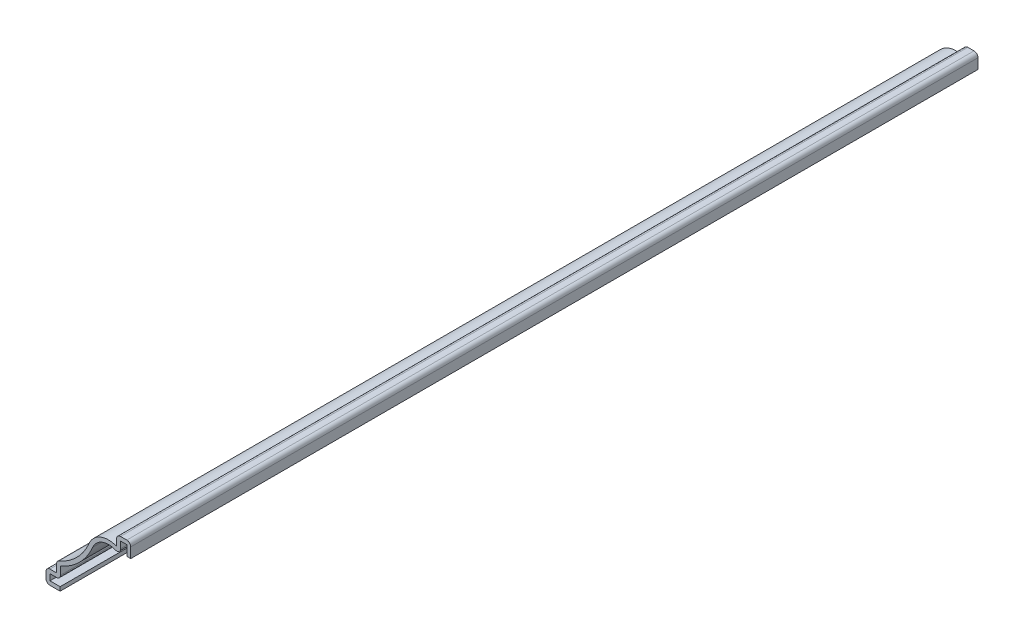
ISO-10303-21;
HEADER;
FILE_DESCRIPTION(('STEP AP214'),'2;1');
FILE_NAME('part.step','',(''),(''),'','','');
FILE_SCHEMA(('AUTOMOTIVE_DESIGN { 1 0 10303 214 1 1 1 1 }'));
ENDSEC;
DATA;
#1=APPLICATION_CONTEXT('core data for automotive mechanical design processes');
#2=APPLICATION_PROTOCOL_DEFINITION('international standard','automotive_design',2000,#1);
#3=PRODUCT_CONTEXT('',#1,'mechanical');
#4=PRODUCT('Part','Part','',(#3));
#5=PRODUCT_RELATED_PRODUCT_CATEGORY('part','',(#4));
#6=PRODUCT_DEFINITION_FORMATION('','',#4);
#7=PRODUCT_DEFINITION_CONTEXT('part definition',#1,'design');
#8=PRODUCT_DEFINITION('design','',#6,#7);
#9=PRODUCT_DEFINITION_SHAPE('','',#8);
#10=(LENGTH_UNIT() NAMED_UNIT(*) SI_UNIT(.MILLI.,.METRE.));
#11=(NAMED_UNIT(*) PLANE_ANGLE_UNIT() SI_UNIT($,.RADIAN.));
#12=(NAMED_UNIT(*) SI_UNIT($,.STERADIAN.) SOLID_ANGLE_UNIT());
#13=UNCERTAINTY_MEASURE_WITH_UNIT(LENGTH_MEASURE(1.E-05),#10,'distance_accuracy_value','');
#14=(GEOMETRIC_REPRESENTATION_CONTEXT(3) GLOBAL_UNCERTAINTY_ASSIGNED_CONTEXT((#13)) GLOBAL_UNIT_ASSIGNED_CONTEXT((#10,
#11,#12)) REPRESENTATION_CONTEXT('',''));
#15=CARTESIAN_POINT('',(0.,0.,0.));
#16=DIRECTION('',(0.,0.,1.));
#17=DIRECTION('',(1.,0.,0.));
#18=AXIS2_PLACEMENT_3D('',#15,#16,#17);
#19=CARTESIAN_POINT('',(-19.05,0.,-190.5));
#20=DIRECTION('',(0.,-1.,0.));
#21=DIRECTION('',(0.,0.,-1.));
#22=AXIS2_PLACEMENT_3D('',#19,#20,#21);
#23=PLANE('',#22);
#24=DIRECTION('',(1.,0.,0.));
#25=VECTOR('',#24,1.);
#26=CARTESIAN_POINT('',(-19.05,0.,0.));
#27=LINE('',#26,#25);
#28=CARTESIAN_POINT('',(-18.161,0.,0.));
#29=VERTEX_POINT('',#28);
#30=CARTESIAN_POINT('',(-15.875,0.,0.));
#31=VERTEX_POINT('',#30);
#32=EDGE_CURVE('E407',#29,#31,#27,.T.);
#33=ORIENTED_EDGE('',*,*,#32,.F.);
#34=DIRECTION('',(0.,0.,1.));
#35=VECTOR('',#34,1.);
#36=CARTESIAN_POINT('',(-18.161,0.,-190.5));
#37=LINE('',#36,#35);
#38=CARTESIAN_POINT('',(-18.161,0.,-190.5));
#39=VERTEX_POINT('',#38);
#40=EDGE_CURVE('E223',#29,#39,#37,.F.);
#41=ORIENTED_EDGE('',*,*,#40,.T.);
#42=DIRECTION('',(1.,0.,0.));
#43=VECTOR('',#42,1.);
#44=CARTESIAN_POINT('',(-19.05,0.,-190.5));
#45=LINE('',#44,#43);
#46=CARTESIAN_POINT('',(-15.875,0.,-190.5));
#47=VERTEX_POINT('',#46);
#48=EDGE_CURVE('E216',#39,#47,#45,.T.);
#49=ORIENTED_EDGE('',*,*,#48,.T.);
#50=DIRECTION('',(0.,0.,1.));
#51=VECTOR('',#50,1.);
#52=CARTESIAN_POINT('',(-15.875,0.,-190.5));
#53=LINE('',#52,#51);
#54=EDGE_CURVE('E220',#47,#31,#53,.T.);
#55=ORIENTED_EDGE('',*,*,#54,.T.);
#56=EDGE_LOOP('',(#33,#41,#49,#55));
#57=FACE_BOUND('',#56,.T.);
#58=ADVANCED_FACE('F35',(#57),#23,.T.);
#59=CARTESIAN_POINT('',(-19.05,3.175,-190.5));
#60=DIRECTION('',(-1.,0.,0.));
#61=DIRECTION('',(0.,0.,1.));
#62=AXIS2_PLACEMENT_3D('',#59,#60,#61);
#63=PLANE('',#62);
#64=DIRECTION('',(0.,-1.,0.));
#65=VECTOR('',#64,1.);
#66=CARTESIAN_POINT('',(-19.05,3.175,-190.5));
#67=LINE('',#66,#65);
#68=CARTESIAN_POINT('',(-19.05,2.286,-190.5));
#69=VERTEX_POINT('',#68);
#70=CARTESIAN_POINT('',(-19.05,0.889,-190.5));
#71=VERTEX_POINT('',#70);
#72=EDGE_CURVE('E241',#69,#71,#67,.T.);
#73=ORIENTED_EDGE('',*,*,#72,.T.);
#74=DIRECTION('',(0.,0.,1.));
#75=VECTOR('',#74,1.);
#76=CARTESIAN_POINT('',(-19.05,0.889,-190.5));
#77=LINE('',#76,#75);
#78=CARTESIAN_POINT('',(-19.05,0.889,0.));
#79=VERTEX_POINT('',#78);
#80=EDGE_CURVE('E287',#71,#79,#77,.T.);
#81=ORIENTED_EDGE('',*,*,#80,.T.);
#82=DIRECTION('',(0.,-1.,0.));
#83=VECTOR('',#82,1.);
#84=CARTESIAN_POINT('',(-19.05,3.175,0.));
#85=LINE('',#84,#83);
#86=CARTESIAN_POINT('',(-19.05,2.286,0.));
#87=VERTEX_POINT('',#86);
#88=EDGE_CURVE('E226',#87,#79,#85,.T.);
#89=ORIENTED_EDGE('',*,*,#88,.F.);
#90=DIRECTION('',(0.,0.,1.));
#91=VECTOR('',#90,1.);
#92=CARTESIAN_POINT('',(-19.05,2.286,-190.5));
#93=LINE('',#92,#91);
#94=EDGE_CURVE('E285',#87,#69,#93,.F.);
#95=ORIENTED_EDGE('',*,*,#94,.T.);
#96=EDGE_LOOP('',(#73,#81,#89,#95));
#97=FACE_BOUND('',#96,.T.);
#98=ADVANCED_FACE('F458',(#97),#63,.T.);
#99=CARTESIAN_POINT('',(-16.66875,3.175,-190.5));
#100=DIRECTION('',(0.,1.,0.));
#101=DIRECTION('',(-1.,0.,0.));
#102=AXIS2_PLACEMENT_3D('',#99,#100,#101);
#103=PLANE('',#102);
#104=DIRECTION('',(-1.,0.,0.));
#105=VECTOR('',#104,1.);
#106=CARTESIAN_POINT('',(-16.66875,3.175,-190.5));
#107=LINE('',#106,#105);
#108=CARTESIAN_POINT('',(-16.66875,3.175,-190.5));
#109=VERTEX_POINT('',#108);
#110=CARTESIAN_POINT('',(-18.161,3.175,-190.5));
#111=VERTEX_POINT('',#110);
#112=EDGE_CURVE('E246',#109,#111,#107,.T.);
#113=ORIENTED_EDGE('',*,*,#112,.T.);
#114=DIRECTION('',(0.,0.,1.));
#115=VECTOR('',#114,1.);
#116=CARTESIAN_POINT('',(-18.161,3.175,-190.5));
#117=LINE('',#116,#115);
#118=CARTESIAN_POINT('',(-18.161,3.175,0.));
#119=VERTEX_POINT('',#118);
#120=EDGE_CURVE('E291',#111,#119,#117,.T.);
#121=ORIENTED_EDGE('',*,*,#120,.T.);
#122=DIRECTION('',(-1.,0.,0.));
#123=VECTOR('',#122,1.);
#124=CARTESIAN_POINT('',(-16.66875,3.175,0.));
#125=LINE('',#124,#123);
#126=CARTESIAN_POINT('',(-16.66875,3.175,0.));
#127=VERTEX_POINT('',#126);
#128=EDGE_CURVE('E364',#127,#119,#125,.T.);
#129=ORIENTED_EDGE('',*,*,#128,.F.);
#130=DIRECTION('',(0.,0.,1.));
#131=VECTOR('',#130,1.);
#132=CARTESIAN_POINT('',(-16.66875,3.175,-190.5));
#133=LINE('',#132,#131);
#134=EDGE_CURVE('E253',#109,#127,#133,.T.);
#135=ORIENTED_EDGE('',*,*,#134,.F.);
#136=EDGE_LOOP('',(#113,#121,#129,#135));
#137=FACE_BOUND('',#136,.T.);
#138=ADVANCED_FACE('F468',(#137),#103,.T.);
#139=CARTESIAN_POINT('',(-16.66875,5.55625,-190.5));
#140=DIRECTION('',(-1.,0.,0.));
#141=DIRECTION('',(0.,0.,1.));
#142=AXIS2_PLACEMENT_3D('',#139,#140,#141);
#143=PLANE('',#142);
#144=DIRECTION('',(0.,-1.,0.));
#145=VECTOR('',#144,1.);
#146=CARTESIAN_POINT('',(-16.66875,5.55625,0.));
#147=LINE('',#146,#145);
#148=CARTESIAN_POINT('',(-16.66875,4.95323651991083,0.));
#149=VERTEX_POINT('',#148);
#150=EDGE_CURVE('E362',#149,#127,#147,.T.);
#151=ORIENTED_EDGE('',*,*,#150,.F.);
#152=DIRECTION('',(0.,0.,1.));
#153=VECTOR('',#152,1.);
#154=CARTESIAN_POINT('',(-16.66875,4.95323651991083,-190.5));
#155=LINE('',#154,#153);
#156=CARTESIAN_POINT('',(-16.66875,4.95323651991083,-190.5));
#157=VERTEX_POINT('',#156);
#158=EDGE_CURVE('E301',#149,#157,#155,.F.);
#159=ORIENTED_EDGE('',*,*,#158,.T.);
#160=DIRECTION('',(0.,-1.,0.));
#161=VECTOR('',#160,1.);
#162=CARTESIAN_POINT('',(-16.66875,5.55625,-190.5));
#163=LINE('',#162,#161);
#164=EDGE_CURVE('E449',#157,#109,#163,.T.);
#165=ORIENTED_EDGE('',*,*,#164,.T.);
#166=ORIENTED_EDGE('',*,*,#134,.T.);
#167=EDGE_LOOP('',(#151,#159,#165,#166));
#168=FACE_BOUND('',#167,.T.);
#169=ADVANCED_FACE('F472',(#168),#143,.T.);
#170=CARTESIAN_POINT('',(-21.0881629629963,17.4625,-190.5));
#171=DIRECTION('',(0.,0.,1.));
#172=DIRECTION('',(1.,0.,0.));
#173=AXIS2_PLACEMENT_3D('',#170,#171,#172);
#174=CYLINDRICAL_SURFACE('',#173,12.7);
#175=CARTESIAN_POINT('',(-21.0881629629963,17.4625,-190.5));
#176=DIRECTION('',(0.,0.,-1.));
#177=DIRECTION('',(-1.,0.,0.));
#178=AXIS2_PLACEMENT_3D('',#175,#176,#177);
#179=CIRCLE('',#178,12.7);
#180=CARTESIAN_POINT('',(-9.38501074974399,12.5303373634432,-190.5));
#181=VERTEX_POINT('',#180);
#182=CARTESIAN_POINT('',(-16.1270293527194,5.77159955131854,-190.5));
#183=VERTEX_POINT('',#182);
#184=EDGE_CURVE('E446',#181,#183,#179,.T.);
#185=ORIENTED_EDGE('',*,*,#184,.T.);
#186=DIRECTION('',(0.,0.,1.));
#187=VECTOR('',#186,1.);
#188=CARTESIAN_POINT('',(-16.1270293527194,5.77159955131854,-190.5));
#189=LINE('',#188,#187);
#190=CARTESIAN_POINT('',(-16.1270293527194,5.77159955131854,0.));
#191=VERTEX_POINT('',#190);
#192=EDGE_CURVE('E298',#183,#191,#189,.T.);
#193=ORIENTED_EDGE('',*,*,#192,.T.);
#194=CARTESIAN_POINT('',(-21.0881629629963,17.4625,0.));
#195=DIRECTION('',(0.,0.,-1.));
#196=DIRECTION('',(-1.,0.,0.));
#197=AXIS2_PLACEMENT_3D('',#194,#195,#196);
#198=CIRCLE('',#197,12.7);
#199=CARTESIAN_POINT('',(-9.38501074974399,12.5303373634432,0.));
#200=VERTEX_POINT('',#199);
#201=EDGE_CURVE('E359',#200,#191,#198,.T.);
#202=ORIENTED_EDGE('',*,*,#201,.F.);
#203=DIRECTION('',(0.,0.,1.));
#204=VECTOR('',#203,1.);
#205=CARTESIAN_POINT('',(-9.38501074974399,12.5303373634432,-190.5));
#206=LINE('',#205,#204);
#207=EDGE_CURVE('E371',#181,#200,#206,.T.);
#208=ORIENTED_EDGE('',*,*,#207,.F.);
#209=EDGE_LOOP('',(#185,#193,#202,#208));
#210=FACE_BOUND('',#209,.T.);
#211=ADVANCED_FACE('F481',(#210),#174,.F.);
#212=CARTESIAN_POINT('',(-4.99632866977436,10.6807763747344,-190.5));
#213=DIRECTION('',(0.,0.,1.));
#214=DIRECTION('',(1.,0.,0.));
#215=AXIS2_PLACEMENT_3D('',#212,#213,#214);
#216=CYLINDRICAL_SURFACE('',#215,4.7625);
#217=CARTESIAN_POINT('',(-4.99632866977436,10.6807763747344,0.));
#218=DIRECTION('',(0.,0.,1.));
#219=DIRECTION('',(1.,0.,0.));
#220=AXIS2_PLACEMENT_3D('',#217,#218,#219);
#221=CIRCLE('',#220,4.7625);
#222=CARTESIAN_POINT('',(-3.175,15.08125,0.));
#223=VERTEX_POINT('',#222);
#224=EDGE_CURVE('E356',#223,#200,#221,.T.);
#225=ORIENTED_EDGE('',*,*,#224,.F.);
#226=DIRECTION('',(0.,0.,1.));
#227=VECTOR('',#226,1.);
#228=CARTESIAN_POINT('',(-3.175,15.08125,-190.5));
#229=LINE('',#228,#227);
#230=CARTESIAN_POINT('',(-3.175,15.08125,-190.5));
#231=VERTEX_POINT('',#230);
#232=EDGE_CURVE('E373',#231,#223,#229,.T.);
#233=ORIENTED_EDGE('',*,*,#232,.F.);
#234=CARTESIAN_POINT('',(-4.99632866977436,10.6807763747344,-190.5));
#235=DIRECTION('',(0.,0.,1.));
#236=DIRECTION('',(1.,0.,0.));
#237=AXIS2_PLACEMENT_3D('',#234,#235,#236);
#238=CIRCLE('',#237,4.7625);
#239=EDGE_CURVE('E443',#231,#181,#238,.T.);
#240=ORIENTED_EDGE('',*,*,#239,.T.);
#241=ORIENTED_EDGE('',*,*,#207,.T.);
#242=EDGE_LOOP('',(#225,#233,#240,#241));
#243=FACE_BOUND('',#242,.T.);
#244=ADVANCED_FACE('F486',(#243),#216,.T.);
#245=CARTESIAN_POINT('',(-3.175,17.4625,-190.5));
#246=DIRECTION('',(-1.,0.,0.));
#247=DIRECTION('',(0.,0.,1.));
#248=AXIS2_PLACEMENT_3D('',#245,#246,#247);
#249=PLANE('',#248);
#250=DIRECTION('',(0.,-1.,0.));
#251=VECTOR('',#250,1.);
#252=CARTESIAN_POINT('',(-3.175,17.4625,0.));
#253=LINE('',#252,#251);
#254=CARTESIAN_POINT('',(-3.175,16.5735,0.));
#255=VERTEX_POINT('',#254);
#256=EDGE_CURVE('E354',#255,#223,#253,.T.);
#257=ORIENTED_EDGE('',*,*,#256,.F.);
#258=DIRECTION('',(0.,0.,1.));
#259=VECTOR('',#258,1.);
#260=CARTESIAN_POINT('',(-3.175,16.5735,-190.5));
#261=LINE('',#260,#259);
#262=CARTESIAN_POINT('',(-3.175,16.5735,-190.5));
#263=VERTEX_POINT('',#262);
#264=EDGE_CURVE('E270',#255,#263,#261,.F.);
#265=ORIENTED_EDGE('',*,*,#264,.T.);
#266=DIRECTION('',(0.,-1.,0.));
#267=VECTOR('',#266,1.);
#268=CARTESIAN_POINT('',(-3.175,17.4625,-190.5));
#269=LINE('',#268,#267);
#270=EDGE_CURVE('E441',#263,#231,#269,.T.);
#271=ORIENTED_EDGE('',*,*,#270,.T.);
#272=ORIENTED_EDGE('',*,*,#232,.T.);
#273=EDGE_LOOP('',(#257,#265,#271,#272));
#274=FACE_BOUND('',#273,.T.);
#275=ADVANCED_FACE('F660',(#274),#249,.T.);
#276=CARTESIAN_POINT('',(0.,17.4625,-190.5));
#277=DIRECTION('',(0.,1.,0.));
#278=DIRECTION('',(0.,0.,1.));
#279=AXIS2_PLACEMENT_3D('',#276,#277,#278);
#280=PLANE('',#279);
#281=DIRECTION('',(-1.,0.,0.));
#282=VECTOR('',#281,1.);
#283=CARTESIAN_POINT('',(0.,17.4625,-190.5));
#284=LINE('',#283,#282);
#285=CARTESIAN_POINT('',(-0.889,17.4625,-190.5));
#286=VERTEX_POINT('',#285);
#287=CARTESIAN_POINT('',(-2.286,17.4625,-190.5));
#288=VERTEX_POINT('',#287);
#289=EDGE_CURVE('E438',#286,#288,#284,.T.);
#290=ORIENTED_EDGE('',*,*,#289,.T.);
#291=DIRECTION('',(0.,0.,1.));
#292=VECTOR('',#291,1.);
#293=CARTESIAN_POINT('',(-2.286,17.4625,-190.5));
#294=LINE('',#293,#292);
#295=CARTESIAN_POINT('',(-2.286,17.4625,0.));
#296=VERTEX_POINT('',#295);
#297=EDGE_CURVE('E252',#288,#296,#294,.T.);
#298=ORIENTED_EDGE('',*,*,#297,.T.);
#299=DIRECTION('',(-1.,0.,0.));
#300=VECTOR('',#299,1.);
#301=CARTESIAN_POINT('',(0.,17.4625,0.));
#302=LINE('',#301,#300);
#303=CARTESIAN_POINT('',(-0.889,17.4625,0.));
#304=VERTEX_POINT('',#303);
#305=EDGE_CURVE('E352',#304,#296,#302,.T.);
#306=ORIENTED_EDGE('',*,*,#305,.F.);
#307=DIRECTION('',(0.,0.,1.));
#308=VECTOR('',#307,1.);
#309=CARTESIAN_POINT('',(-0.889,17.4625,-190.5));
#310=LINE('',#309,#308);
#311=EDGE_CURVE('E250',#304,#286,#310,.F.);
#312=ORIENTED_EDGE('',*,*,#311,.T.);
#313=EDGE_LOOP('',(#290,#298,#306,#312));
#314=FACE_BOUND('',#313,.T.);
#315=ADVANCED_FACE('F497',(#314),#280,.T.);
#316=CARTESIAN_POINT('',(0.,14.2875,-190.5));
#317=DIRECTION('',(1.,0.,0.));
#318=DIRECTION('',(0.,0.,-1.));
#319=AXIS2_PLACEMENT_3D('',#316,#317,#318);
#320=PLANE('',#319);
#321=DIRECTION('',(0.,1.,0.));
#322=VECTOR('',#321,1.);
#323=CARTESIAN_POINT('',(0.,14.2875,-190.5));
#324=LINE('',#323,#322);
#325=CARTESIAN_POINT('',(0.,14.2875,-190.5));
#326=VERTEX_POINT('',#325);
#327=CARTESIAN_POINT('',(0.,16.5735,-190.5));
#328=VERTEX_POINT('',#327);
#329=EDGE_CURVE('E435',#326,#328,#324,.T.);
#330=ORIENTED_EDGE('',*,*,#329,.T.);
#331=DIRECTION('',(0.,0.,1.));
#332=VECTOR('',#331,1.);
#333=CARTESIAN_POINT('',(0.,16.5735,-190.5));
#334=LINE('',#333,#332);
#335=CARTESIAN_POINT('',(0.,16.5735,0.));
#336=VERTEX_POINT('',#335);
#337=EDGE_CURVE('E11',#328,#336,#334,.T.);
#338=ORIENTED_EDGE('',*,*,#337,.T.);
#339=DIRECTION('',(0.,1.,0.));
#340=VECTOR('',#339,1.);
#341=CARTESIAN_POINT('',(0.,14.2875,0.));
#342=LINE('',#341,#340);
#343=CARTESIAN_POINT('',(0.,14.2875,0.));
#344=VERTEX_POINT('',#343);
#345=EDGE_CURVE('E349',#344,#336,#342,.T.);
#346=ORIENTED_EDGE('',*,*,#345,.F.);
#347=DIRECTION('',(0.,0.,1.));
#348=VECTOR('',#347,1.);
#349=CARTESIAN_POINT('',(0.,14.2875,-190.5));
#350=LINE('',#349,#348);
#351=EDGE_CURVE('E376',#326,#344,#350,.T.);
#352=ORIENTED_EDGE('',*,*,#351,.F.);
#353=EDGE_LOOP('',(#330,#338,#346,#352));
#354=FACE_BOUND('',#353,.T.);
#355=ADVANCED_FACE('F505',(#354),#320,.T.);
#356=CARTESIAN_POINT('',(0.,14.2875,-190.5));
#357=DIRECTION('',(0.,1.,0.));
#358=DIRECTION('',(0.,0.,1.));
#359=AXIS2_PLACEMENT_3D('',#356,#357,#358);
#360=PLANE('',#359);
#361=DIRECTION('',(-1.,0.,0.));
#362=VECTOR('',#361,1.);
#363=CARTESIAN_POINT('',(0.,14.2875,0.));
#364=LINE('',#363,#362);
#365=CARTESIAN_POINT('',(-0.889,14.2875,0.));
#366=VERTEX_POINT('',#365);
#367=EDGE_CURVE('E347',#344,#366,#364,.T.);
#368=ORIENTED_EDGE('',*,*,#367,.T.);
#369=DIRECTION('',(0.,0.,1.));
#370=VECTOR('',#369,1.);
#371=CARTESIAN_POINT('',(-0.889,14.2875,-190.5));
#372=LINE('',#371,#370);
#373=CARTESIAN_POINT('',(-0.889,14.2875,-190.5));
#374=VERTEX_POINT('',#373);
#375=EDGE_CURVE('E378',#374,#366,#372,.T.);
#376=ORIENTED_EDGE('',*,*,#375,.F.);
#377=DIRECTION('',(-1.,0.,0.));
#378=VECTOR('',#377,1.);
#379=CARTESIAN_POINT('',(0.,14.2875,-190.5));
#380=LINE('',#379,#378);
#381=EDGE_CURVE('E433',#326,#374,#380,.T.);
#382=ORIENTED_EDGE('',*,*,#381,.F.);
#383=ORIENTED_EDGE('',*,*,#351,.T.);
#384=EDGE_LOOP('',(#368,#376,#382,#383));
#385=FACE_BOUND('',#384,.T.);
#386=ADVANCED_FACE('F512',(#385),#360,.F.);
#387=CARTESIAN_POINT('',(-0.889,14.2875,-190.5));
#388=DIRECTION('',(1.,0.,0.));
#389=DIRECTION('',(0.,0.,-1.));
#390=AXIS2_PLACEMENT_3D('',#387,#388,#389);
#391=PLANE('',#390);
#392=DIRECTION('',(0.,1.,0.));
#393=VECTOR('',#392,1.);
#394=CARTESIAN_POINT('',(-0.889,14.2875,0.));
#395=LINE('',#394,#393);
#396=CARTESIAN_POINT('',(-0.889,16.5735,0.));
#397=VERTEX_POINT('',#396);
#398=EDGE_CURVE('E345',#366,#397,#395,.T.);
#399=ORIENTED_EDGE('',*,*,#398,.T.);
#400=DIRECTION('',(0.,0.,1.));
#401=VECTOR('',#400,1.);
#402=CARTESIAN_POINT('',(-0.889,16.5735,-190.5));
#403=LINE('',#402,#401);
#404=CARTESIAN_POINT('',(-0.889,16.5735,-190.5));
#405=VERTEX_POINT('',#404);
#406=EDGE_CURVE('E381',#405,#397,#403,.T.);
#407=ORIENTED_EDGE('',*,*,#406,.F.);
#408=DIRECTION('',(0.,1.,0.));
#409=VECTOR('',#408,1.);
#410=CARTESIAN_POINT('',(-0.889,14.2875,-190.5));
#411=LINE('',#410,#409);
#412=EDGE_CURVE('E431',#374,#405,#411,.T.);
#413=ORIENTED_EDGE('',*,*,#412,.F.);
#414=ORIENTED_EDGE('',*,*,#375,.T.);
#415=EDGE_LOOP('',(#399,#407,#413,#414));
#416=FACE_BOUND('',#415,.T.);
#417=ADVANCED_FACE('F515',(#416),#391,.F.);
#418=CARTESIAN_POINT('',(0.,16.5735,-190.5));
#419=DIRECTION('',(0.,1.,0.));
#420=DIRECTION('',(0.,0.,1.));
#421=AXIS2_PLACEMENT_3D('',#418,#419,#420);
#422=PLANE('',#421);
#423=DIRECTION('',(1.,0.,0.));
#424=VECTOR('',#423,1.);
#425=CARTESIAN_POINT('',(0.,16.5735,0.));
#426=LINE('',#425,#424);
#427=CARTESIAN_POINT('',(-2.286,16.5735,0.));
#428=VERTEX_POINT('',#427);
#429=EDGE_CURVE('E338',#397,#428,#426,.F.);
#430=ORIENTED_EDGE('',*,*,#429,.T.);
#431=DIRECTION('',(0.,0.,1.));
#432=VECTOR('',#431,1.);
#433=CARTESIAN_POINT('',(-2.286,16.5735,-190.5));
#434=LINE('',#433,#432);
#435=CARTESIAN_POINT('',(-2.286,16.5735,-190.5));
#436=VERTEX_POINT('',#435);
#437=EDGE_CURVE('E384',#436,#428,#434,.T.);
#438=ORIENTED_EDGE('',*,*,#437,.F.);
#439=DIRECTION('',(1.,0.,0.));
#440=VECTOR('',#439,1.);
#441=CARTESIAN_POINT('',(0.,16.5735,-190.5));
#442=LINE('',#441,#440);
#443=EDGE_CURVE('E319',#405,#436,#442,.F.);
#444=ORIENTED_EDGE('',*,*,#443,.F.);
#445=ORIENTED_EDGE('',*,*,#406,.T.);
#446=EDGE_LOOP('',(#430,#438,#444,#445));
#447=FACE_BOUND('',#446,.T.);
#448=ADVANCED_FACE('F518',(#447),#422,.F.);
#449=CARTESIAN_POINT('',(-2.286,17.4625,-190.5));
#450=DIRECTION('',(-1.,0.,0.));
#451=DIRECTION('',(0.,0.,1.));
#452=AXIS2_PLACEMENT_3D('',#449,#450,#451);
#453=PLANE('',#452);
#454=DIRECTION('',(0.,1.,0.));
#455=VECTOR('',#454,1.);
#456=CARTESIAN_POINT('',(-2.286,17.4625,0.));
#457=LINE('',#456,#455);
#458=CARTESIAN_POINT('',(-2.286,15.08125,0.));
#459=VERTEX_POINT('',#458);
#460=EDGE_CURVE('E314',#428,#459,#457,.F.);
#461=ORIENTED_EDGE('',*,*,#460,.T.);
#462=DIRECTION('',(0.,0.,1.));
#463=VECTOR('',#462,1.);
#464=CARTESIAN_POINT('',(-2.286,15.08125,-190.5));
#465=LINE('',#464,#463);
#466=CARTESIAN_POINT('',(-2.286,15.08125,-190.5));
#467=VERTEX_POINT('',#466);
#468=EDGE_CURVE('E43',#459,#467,#465,.F.);
#469=ORIENTED_EDGE('',*,*,#468,.T.);
#470=DIRECTION('',(0.,1.,0.));
#471=VECTOR('',#470,1.);
#472=CARTESIAN_POINT('',(-2.286,17.4625,-190.5));
#473=LINE('',#472,#471);
#474=EDGE_CURVE('E312',#436,#467,#473,.F.);
#475=ORIENTED_EDGE('',*,*,#474,.F.);
#476=ORIENTED_EDGE('',*,*,#437,.T.);
#477=EDGE_LOOP('',(#461,#469,#475,#476));
#478=FACE_BOUND('',#477,.T.);
#479=ADVANCED_FACE('F310',(#478),#453,.F.);
#480=CARTESIAN_POINT('',(-4.99632866977436,10.6807763747344,-190.5));
#481=DIRECTION('',(0.,0.,1.));
#482=DIRECTION('',(1.,0.,0.));
#483=AXIS2_PLACEMENT_3D('',#480,#481,#482);
#484=CYLINDRICAL_SURFACE('',#483,3.8735);
#485=CARTESIAN_POINT('',(-4.99632866977436,10.6807763747344,-190.5));
#486=DIRECTION('',(0.,0.,1.));
#487=DIRECTION('',(1.,0.,0.));
#488=AXIS2_PLACEMENT_3D('',#485,#486,#487);
#489=CIRCLE('',#488,3.8735);
#490=CARTESIAN_POINT('',(-3.51498135169121,14.2598282566171,-190.5));
#491=VERTEX_POINT('',#490);
#492=CARTESIAN_POINT('',(-8.56579009481633,12.1850859788842,-190.5));
#493=VERTEX_POINT('',#492);
#494=EDGE_CURVE('E321',#491,#493,#489,.T.);
#495=ORIENTED_EDGE('',*,*,#494,.F.);
#496=DIRECTION('',(0.,0.,1.));
#497=VECTOR('',#496,1.);
#498=CARTESIAN_POINT('',(-3.51498135169121,14.2598282566171,-190.5));
#499=LINE('',#498,#497);
#500=CARTESIAN_POINT('',(-3.51498135169121,14.2598282566171,0.));
#501=VERTEX_POINT('',#500);
#502=EDGE_CURVE('E303',#491,#501,#499,.T.);
#503=ORIENTED_EDGE('',*,*,#502,.T.);
#504=CARTESIAN_POINT('',(-4.99632866977436,10.6807763747344,0.));
#505=DIRECTION('',(0.,0.,1.));
#506=DIRECTION('',(1.,0.,0.));
#507=AXIS2_PLACEMENT_3D('',#504,#505,#506);
#508=CIRCLE('',#507,3.8735);
#509=CARTESIAN_POINT('',(-8.56579009481633,12.1850859788842,0.));
#510=VERTEX_POINT('',#509);
#511=EDGE_CURVE('E329',#501,#510,#508,.T.);
#512=ORIENTED_EDGE('',*,*,#511,.T.);
#513=DIRECTION('',(0.,0.,1.));
#514=VECTOR('',#513,1.);
#515=CARTESIAN_POINT('',(-8.56579009481633,12.1850859788842,-190.5));
#516=LINE('',#515,#514);
#517=EDGE_CURVE('E386',#493,#510,#516,.T.);
#518=ORIENTED_EDGE('',*,*,#517,.F.);
#519=EDGE_LOOP('',(#495,#503,#512,#518));
#520=FACE_BOUND('',#519,.T.);
#521=ADVANCED_FACE('F327',(#520),#484,.F.);
#522=CARTESIAN_POINT('',(-21.0881629629963,17.4625,-190.5));
#523=DIRECTION('',(0.,0.,1.));
#524=DIRECTION('',(1.,0.,0.));
#525=AXIS2_PLACEMENT_3D('',#522,#523,#524);
#526=CYLINDRICAL_SURFACE('',#525,13.589);
#527=CARTESIAN_POINT('',(-21.0881629629963,17.4625,0.));
#528=DIRECTION('',(0.,0.,1.));
#529=DIRECTION('',(1.,0.,0.));
#530=AXIS2_PLACEMENT_3D('',#527,#528,#529);
#531=CIRCLE('',#530,13.589);
#532=CARTESIAN_POINT('',(-15.77975,4.95323651991083,0.));
#533=VERTEX_POINT('',#532);
#534=EDGE_CURVE('E336',#510,#533,#531,.F.);
#535=ORIENTED_EDGE('',*,*,#534,.T.);
#536=DIRECTION('',(0.,0.,1.));
#537=VECTOR('',#536,1.);
#538=CARTESIAN_POINT('',(-15.77975,4.95323651991083,-190.5));
#539=LINE('',#538,#537);
#540=CARTESIAN_POINT('',(-15.77975,4.95323651991083,-190.5));
#541=VERTEX_POINT('',#540);
#542=EDGE_CURVE('E388',#541,#533,#539,.T.);
#543=ORIENTED_EDGE('',*,*,#542,.F.);
#544=CARTESIAN_POINT('',(-21.0881629629963,17.4625,-190.5));
#545=DIRECTION('',(0.,0.,1.));
#546=DIRECTION('',(1.,0.,0.));
#547=AXIS2_PLACEMENT_3D('',#544,#545,#546);
#548=CIRCLE('',#547,13.589);
#549=EDGE_CURVE('E423',#493,#541,#548,.F.);
#550=ORIENTED_EDGE('',*,*,#549,.F.);
#551=ORIENTED_EDGE('',*,*,#517,.T.);
#552=EDGE_LOOP('',(#535,#543,#550,#551));
#553=FACE_BOUND('',#552,.T.);
#554=ADVANCED_FACE('F624',(#553),#526,.T.);
#555=CARTESIAN_POINT('',(-15.77975,5.55625,-190.5));
#556=DIRECTION('',(-1.,0.,0.));
#557=DIRECTION('',(0.,0.,1.));
#558=AXIS2_PLACEMENT_3D('',#555,#556,#557);
#559=PLANE('',#558);
#560=DIRECTION('',(0.,1.,0.));
#561=VECTOR('',#560,1.);
#562=CARTESIAN_POINT('',(-15.77975,5.55625,0.));
#563=LINE('',#562,#561);
#564=CARTESIAN_POINT('',(-15.77975,3.175,0.));
#565=VERTEX_POINT('',#564);
#566=EDGE_CURVE('E340',#533,#565,#563,.F.);
#567=ORIENTED_EDGE('',*,*,#566,.T.);
#568=DIRECTION('',(0.,0.,1.));
#569=VECTOR('',#568,1.);
#570=CARTESIAN_POINT('',(-15.77975,3.175,-190.5));
#571=LINE('',#570,#569);
#572=CARTESIAN_POINT('',(-15.77975,3.175,-190.5));
#573=VERTEX_POINT('',#572);
#574=EDGE_CURVE('E58',#565,#573,#571,.F.);
#575=ORIENTED_EDGE('',*,*,#574,.T.);
#576=DIRECTION('',(0.,1.,0.));
#577=VECTOR('',#576,1.);
#578=CARTESIAN_POINT('',(-15.77975,5.55625,-190.5));
#579=LINE('',#578,#577);
#580=EDGE_CURVE('E420',#541,#573,#579,.F.);
#581=ORIENTED_EDGE('',*,*,#580,.F.);
#582=ORIENTED_EDGE('',*,*,#542,.T.);
#583=EDGE_LOOP('',(#567,#575,#581,#582));
#584=FACE_BOUND('',#583,.T.);
#585=ADVANCED_FACE('F411',(#584),#559,.F.);
#586=CARTESIAN_POINT('',(-16.66875,2.286,-190.5));
#587=DIRECTION('',(0.,1.,0.));
#588=DIRECTION('',(-1.,0.,0.));
#589=AXIS2_PLACEMENT_3D('',#586,#587,#588);
#590=PLANE('',#589);
#591=DIRECTION('',(-1.,0.,0.));
#592=VECTOR('',#591,1.);
#593=CARTESIAN_POINT('',(-16.66875,2.286,-190.5));
#594=LINE('',#593,#592);
#595=CARTESIAN_POINT('',(-16.66875,2.286,-190.5));
#596=VERTEX_POINT('',#595);
#597=CARTESIAN_POINT('',(-18.161,2.286,-190.5));
#598=VERTEX_POINT('',#597);
#599=EDGE_CURVE('E419',#596,#598,#594,.T.);
#600=ORIENTED_EDGE('',*,*,#599,.F.);
#601=DIRECTION('',(0.,0.,1.));
#602=VECTOR('',#601,1.);
#603=CARTESIAN_POINT('',(-16.66875,2.286,-190.5));
#604=LINE('',#603,#602);
#605=CARTESIAN_POINT('',(-16.66875,2.286,0.));
#606=VERTEX_POINT('',#605);
#607=EDGE_CURVE('E294',#596,#606,#604,.T.);
#608=ORIENTED_EDGE('',*,*,#607,.T.);
#609=DIRECTION('',(-1.,0.,0.));
#610=VECTOR('',#609,1.);
#611=CARTESIAN_POINT('',(-16.66875,2.286,0.));
#612=LINE('',#611,#610);
#613=CARTESIAN_POINT('',(-18.161,2.286,0.));
#614=VERTEX_POINT('',#613);
#615=EDGE_CURVE('E405',#606,#614,#612,.T.);
#616=ORIENTED_EDGE('',*,*,#615,.T.);
#617=DIRECTION('',(0.,0.,1.));
#618=VECTOR('',#617,1.);
#619=CARTESIAN_POINT('',(-18.161,2.286,-190.5));
#620=LINE('',#619,#618);
#621=EDGE_CURVE('E391',#598,#614,#620,.T.);
#622=ORIENTED_EDGE('',*,*,#621,.F.);
#623=EDGE_LOOP('',(#600,#608,#616,#622));
#624=FACE_BOUND('',#623,.T.);
#625=ADVANCED_FACE('F417',(#624),#590,.F.);
#626=CARTESIAN_POINT('',(-18.161,3.175,-190.5));
#627=DIRECTION('',(-1.,0.,0.));
#628=DIRECTION('',(0.,0.,1.));
#629=AXIS2_PLACEMENT_3D('',#626,#627,#628);
#630=PLANE('',#629);
#631=DIRECTION('',(0.,1.,0.));
#632=VECTOR('',#631,1.);
#633=CARTESIAN_POINT('',(-18.161,3.175,0.));
#634=LINE('',#633,#632);
#635=CARTESIAN_POINT('',(-18.161,0.889,0.));
#636=VERTEX_POINT('',#635);
#637=EDGE_CURVE('E403',#614,#636,#634,.F.);
#638=ORIENTED_EDGE('',*,*,#637,.T.);
#639=DIRECTION('',(0.,0.,1.));
#640=VECTOR('',#639,1.);
#641=CARTESIAN_POINT('',(-18.161,0.889,-190.5));
#642=LINE('',#641,#640);
#643=CARTESIAN_POINT('',(-18.161,0.889,-190.5));
#644=VERTEX_POINT('',#643);
#645=EDGE_CURVE('E243',#644,#636,#642,.T.);
#646=ORIENTED_EDGE('',*,*,#645,.F.);
#647=DIRECTION('',(0.,1.,0.));
#648=VECTOR('',#647,1.);
#649=CARTESIAN_POINT('',(-18.161,3.175,-190.5));
#650=LINE('',#649,#648);
#651=EDGE_CURVE('E421',#598,#644,#650,.F.);
#652=ORIENTED_EDGE('',*,*,#651,.F.);
#653=ORIENTED_EDGE('',*,*,#621,.T.);
#654=EDGE_LOOP('',(#638,#646,#652,#653));
#655=FACE_BOUND('',#654,.T.);
#656=ADVANCED_FACE('F613',(#655),#630,.F.);
#657=CARTESIAN_POINT('',(-19.05,0.889,-190.5));
#658=DIRECTION('',(0.,-1.,0.));
#659=DIRECTION('',(0.,0.,-1.));
#660=AXIS2_PLACEMENT_3D('',#657,#658,#659);
#661=PLANE('',#660);
#662=DIRECTION('',(1.,0.,0.));
#663=VECTOR('',#662,1.);
#664=CARTESIAN_POINT('',(-19.05,0.889,0.));
#665=LINE('',#664,#663);
#666=CARTESIAN_POINT('',(-15.875,0.889,0.));
#667=VERTEX_POINT('',#666);
#668=EDGE_CURVE('E398',#636,#667,#665,.T.);
#669=ORIENTED_EDGE('',*,*,#668,.T.);
#670=DIRECTION('',(0.,0.,1.));
#671=VECTOR('',#670,1.);
#672=CARTESIAN_POINT('',(-15.875,0.889,-190.5));
#673=LINE('',#672,#671);
#674=CARTESIAN_POINT('',(-15.875,0.889,-190.5));
#675=VERTEX_POINT('',#674);
#676=EDGE_CURVE('E240',#675,#667,#673,.T.);
#677=ORIENTED_EDGE('',*,*,#676,.F.);
#678=DIRECTION('',(1.,0.,0.));
#679=VECTOR('',#678,1.);
#680=CARTESIAN_POINT('',(-19.05,0.889,-190.5));
#681=LINE('',#680,#679);
#682=EDGE_CURVE('E232',#644,#675,#681,.T.);
#683=ORIENTED_EDGE('',*,*,#682,.F.);
#684=ORIENTED_EDGE('',*,*,#645,.T.);
#685=EDGE_LOOP('',(#669,#677,#683,#684));
#686=FACE_BOUND('',#685,.T.);
#687=ADVANCED_FACE('F397',(#686),#661,.F.);
#688=CARTESIAN_POINT('',(-15.875,0.889,-190.5));
#689=DIRECTION('',(-1.,0.,0.));
#690=DIRECTION('',(0.,0.,1.));
#691=AXIS2_PLACEMENT_3D('',#688,#689,#690);
#692=PLANE('',#691);
#693=DIRECTION('',(0.,-1.,0.));
#694=VECTOR('',#693,1.);
#695=CARTESIAN_POINT('',(-15.875,0.889,0.));
#696=LINE('',#695,#694);
#697=EDGE_CURVE('E239',#667,#31,#696,.T.);
#698=ORIENTED_EDGE('',*,*,#697,.T.);
#699=ORIENTED_EDGE('',*,*,#54,.F.);
#700=DIRECTION('',(0.,-1.,0.));
#701=VECTOR('',#700,1.);
#702=CARTESIAN_POINT('',(-15.875,0.889,-190.5));
#703=LINE('',#702,#701);
#704=EDGE_CURVE('E225',#675,#47,#703,.T.);
#705=ORIENTED_EDGE('',*,*,#704,.F.);
#706=ORIENTED_EDGE('',*,*,#676,.T.);
#707=EDGE_LOOP('',(#698,#699,#705,#706));
#708=FACE_BOUND('',#707,.T.);
#709=ADVANCED_FACE('F237',(#708),#692,.F.);
#710=CARTESIAN_POINT('',(-21.0881629629963,17.4625,-190.5));
#711=DIRECTION('',(0.,0.,1.));
#712=DIRECTION('',(1.,0.,0.));
#713=AXIS2_PLACEMENT_3D('',#710,#711,#712);
#714=PLANE('',#713);
#715=ORIENTED_EDGE('',*,*,#270,.F.);
#716=CARTESIAN_POINT('',(-2.286,16.5735,-190.5));
#717=DIRECTION('',(0.,0.,1.));
#718=DIRECTION('',(1.,0.,0.));
#719=AXIS2_PLACEMENT_3D('',#716,#717,#718);
#720=CIRCLE('',#719,0.889);
#721=EDGE_CURVE('E283',#263,#288,#720,.F.);
#722=ORIENTED_EDGE('',*,*,#721,.T.);
#723=ORIENTED_EDGE('',*,*,#289,.F.);
#724=CARTESIAN_POINT('',(-0.889,16.5735,-190.5));
#725=DIRECTION('',(0.,0.,1.));
#726=DIRECTION('',(1.,0.,0.));
#727=AXIS2_PLACEMENT_3D('',#724,#725,#726);
#728=CIRCLE('',#727,0.889);
#729=EDGE_CURVE('E272',#286,#328,#728,.F.);
#730=ORIENTED_EDGE('',*,*,#729,.T.);
#731=ORIENTED_EDGE('',*,*,#329,.F.);
#732=ORIENTED_EDGE('',*,*,#381,.T.);
#733=ORIENTED_EDGE('',*,*,#412,.T.);
#734=ORIENTED_EDGE('',*,*,#443,.T.);
#735=ORIENTED_EDGE('',*,*,#474,.T.);
#736=CARTESIAN_POINT('',(-3.175,15.08125,-190.5));
#737=DIRECTION('',(0.,0.,1.));
#738=DIRECTION('',(1.,0.,0.));
#739=AXIS2_PLACEMENT_3D('',#736,#737,#738);
#740=CIRCLE('',#739,0.889);
#741=EDGE_CURVE('E274',#467,#491,#740,.F.);
#742=ORIENTED_EDGE('',*,*,#741,.T.);
#743=ORIENTED_EDGE('',*,*,#494,.T.);
#744=ORIENTED_EDGE('',*,*,#549,.T.);
#745=ORIENTED_EDGE('',*,*,#580,.T.);
#746=CARTESIAN_POINT('',(-16.66875,3.175,-190.5));
#747=DIRECTION('',(0.,0.,1.));
#748=DIRECTION('',(1.,0.,0.));
#749=AXIS2_PLACEMENT_3D('',#746,#747,#748);
#750=CIRCLE('',#749,0.889);
#751=EDGE_CURVE('E50',#573,#596,#750,.F.);
#752=ORIENTED_EDGE('',*,*,#751,.T.);
#753=ORIENTED_EDGE('',*,*,#599,.T.);
#754=ORIENTED_EDGE('',*,*,#651,.T.);
#755=ORIENTED_EDGE('',*,*,#682,.T.);
#756=ORIENTED_EDGE('',*,*,#704,.T.);
#757=ORIENTED_EDGE('',*,*,#48,.F.);
#758=CARTESIAN_POINT('',(-18.161,0.889,-190.5));
#759=DIRECTION('',(0.,0.,1.));
#760=DIRECTION('',(1.,0.,0.));
#761=AXIS2_PLACEMENT_3D('',#758,#759,#760);
#762=CIRCLE('',#761,0.889);
#763=EDGE_CURVE('E281',#39,#71,#762,.F.);
#764=ORIENTED_EDGE('',*,*,#763,.T.);
#765=ORIENTED_EDGE('',*,*,#72,.F.);
#766=CARTESIAN_POINT('',(-18.161,2.286,-190.5));
#767=DIRECTION('',(0.,0.,1.));
#768=DIRECTION('',(1.,0.,0.));
#769=AXIS2_PLACEMENT_3D('',#766,#767,#768);
#770=CIRCLE('',#769,0.889);
#771=EDGE_CURVE('E279',#69,#111,#770,.F.);
#772=ORIENTED_EDGE('',*,*,#771,.T.);
#773=ORIENTED_EDGE('',*,*,#112,.F.);
#774=ORIENTED_EDGE('',*,*,#164,.F.);
#775=CARTESIAN_POINT('',(-15.77975,4.95323651991083,-190.5));
#776=DIRECTION('',(0.,0.,1.));
#777=DIRECTION('',(1.,0.,0.));
#778=AXIS2_PLACEMENT_3D('',#775,#776,#777);
#779=CIRCLE('',#778,0.889);
#780=EDGE_CURVE('E276',#157,#183,#779,.F.);
#781=ORIENTED_EDGE('',*,*,#780,.T.);
#782=ORIENTED_EDGE('',*,*,#184,.F.);
#783=ORIENTED_EDGE('',*,*,#239,.F.);
#784=EDGE_LOOP('',(#715,#722,#723,#730,#731,#732,#733,#734,#735,#742,#743,#744,#745,#752,#753,
#754,#755,#756,#757,#764,#765,#772,#773,#774,#781,#782,#783));
#785=FACE_BOUND('',#784,.T.);
#786=ADVANCED_FACE('F230',(#785),#714,.F.);
#787=CARTESIAN_POINT('',(-21.0881629629963,17.4625,0.));
#788=DIRECTION('',(0.,0.,1.));
#789=DIRECTION('',(1.,0.,0.));
#790=AXIS2_PLACEMENT_3D('',#787,#788,#789);
#791=PLANE('',#790);
#792=ORIENTED_EDGE('',*,*,#305,.T.);
#793=CARTESIAN_POINT('',(-2.286,16.5735,0.));
#794=DIRECTION('',(0.,0.,1.));
#795=DIRECTION('',(1.,0.,0.));
#796=AXIS2_PLACEMENT_3D('',#793,#794,#795);
#797=CIRCLE('',#796,0.889);
#798=EDGE_CURVE('E268',#296,#255,#797,.T.);
#799=ORIENTED_EDGE('',*,*,#798,.T.);
#800=ORIENTED_EDGE('',*,*,#256,.T.);
#801=ORIENTED_EDGE('',*,*,#224,.T.);
#802=ORIENTED_EDGE('',*,*,#201,.T.);
#803=CARTESIAN_POINT('',(-15.77975,4.95323651991083,0.));
#804=DIRECTION('',(0.,0.,1.));
#805=DIRECTION('',(1.,0.,0.));
#806=AXIS2_PLACEMENT_3D('',#803,#804,#805);
#807=CIRCLE('',#806,0.889);
#808=EDGE_CURVE('E260',#191,#149,#807,.T.);
#809=ORIENTED_EDGE('',*,*,#808,.T.);
#810=ORIENTED_EDGE('',*,*,#150,.T.);
#811=ORIENTED_EDGE('',*,*,#128,.T.);
#812=CARTESIAN_POINT('',(-18.161,2.286,0.));
#813=DIRECTION('',(0.,0.,1.));
#814=DIRECTION('',(1.,0.,0.));
#815=AXIS2_PLACEMENT_3D('',#812,#813,#814);
#816=CIRCLE('',#815,0.889);
#817=EDGE_CURVE('E264',#119,#87,#816,.T.);
#818=ORIENTED_EDGE('',*,*,#817,.T.);
#819=ORIENTED_EDGE('',*,*,#88,.T.);
#820=CARTESIAN_POINT('',(-18.161,0.889,0.));
#821=DIRECTION('',(0.,0.,1.));
#822=DIRECTION('',(1.,0.,0.));
#823=AXIS2_PLACEMENT_3D('',#820,#821,#822);
#824=CIRCLE('',#823,0.889);
#825=EDGE_CURVE('E266',#79,#29,#824,.T.);
#826=ORIENTED_EDGE('',*,*,#825,.T.);
#827=ORIENTED_EDGE('',*,*,#32,.T.);
#828=ORIENTED_EDGE('',*,*,#697,.F.);
#829=ORIENTED_EDGE('',*,*,#668,.F.);
#830=ORIENTED_EDGE('',*,*,#637,.F.);
#831=ORIENTED_EDGE('',*,*,#615,.F.);
#832=CARTESIAN_POINT('',(-16.66875,3.175,0.));
#833=DIRECTION('',(0.,0.,1.));
#834=DIRECTION('',(1.,0.,0.));
#835=AXIS2_PLACEMENT_3D('',#832,#833,#834);
#836=CIRCLE('',#835,0.889);
#837=EDGE_CURVE('E262',#606,#565,#836,.T.);
#838=ORIENTED_EDGE('',*,*,#837,.T.);
#839=ORIENTED_EDGE('',*,*,#566,.F.);
#840=ORIENTED_EDGE('',*,*,#534,.F.);
#841=ORIENTED_EDGE('',*,*,#511,.F.);
#842=CARTESIAN_POINT('',(-3.175,15.08125,0.));
#843=DIRECTION('',(0.,0.,1.));
#844=DIRECTION('',(1.,0.,0.));
#845=AXIS2_PLACEMENT_3D('',#842,#843,#844);
#846=CIRCLE('',#845,0.889);
#847=EDGE_CURVE('E258',#501,#459,#846,.T.);
#848=ORIENTED_EDGE('',*,*,#847,.T.);
#849=ORIENTED_EDGE('',*,*,#460,.F.);
#850=ORIENTED_EDGE('',*,*,#429,.F.);
#851=ORIENTED_EDGE('',*,*,#398,.F.);
#852=ORIENTED_EDGE('',*,*,#367,.F.);
#853=ORIENTED_EDGE('',*,*,#345,.T.);
#854=CARTESIAN_POINT('',(-0.889,16.5735,0.));
#855=DIRECTION('',(0.,0.,1.));
#856=DIRECTION('',(1.,0.,0.));
#857=AXIS2_PLACEMENT_3D('',#854,#855,#856);
#858=CIRCLE('',#857,0.889);
#859=EDGE_CURVE('E256',#336,#304,#858,.T.);
#860=ORIENTED_EDGE('',*,*,#859,.T.);
#861=EDGE_LOOP('',(#792,#799,#800,#801,#802,#809,#810,#811,#818,#819,#826,#827,#828,#829,#830,
#831,#838,#839,#840,#841,#848,#849,#850,#851,#852,#853,#860));
#862=FACE_BOUND('',#861,.T.);
#863=ADVANCED_FACE('F334',(#862),#791,.T.);
#864=CARTESIAN_POINT('',(-2.286,16.5735,-190.5));
#865=DIRECTION('',(0.,0.,1.));
#866=DIRECTION('',(1.,0.,0.));
#867=AXIS2_PLACEMENT_3D('',#864,#865,#866);
#868=CYLINDRICAL_SURFACE('',#867,0.889);
#869=ORIENTED_EDGE('',*,*,#721,.F.);
#870=ORIENTED_EDGE('',*,*,#264,.F.);
#871=ORIENTED_EDGE('',*,*,#798,.F.);
#872=ORIENTED_EDGE('',*,*,#297,.F.);
#873=EDGE_LOOP('',(#869,#870,#871,#872));
#874=FACE_BOUND('',#873,.T.);
#875=ADVANCED_FACE('F494',(#874),#868,.T.);
#876=CARTESIAN_POINT('',(-18.161,0.889,-190.5));
#877=DIRECTION('',(0.,0.,1.));
#878=DIRECTION('',(1.,0.,0.));
#879=AXIS2_PLACEMENT_3D('',#876,#877,#878);
#880=CYLINDRICAL_SURFACE('',#879,0.889);
#881=ORIENTED_EDGE('',*,*,#763,.F.);
#882=ORIENTED_EDGE('',*,*,#40,.F.);
#883=ORIENTED_EDGE('',*,*,#825,.F.);
#884=ORIENTED_EDGE('',*,*,#80,.F.);
#885=EDGE_LOOP('',(#881,#882,#883,#884));
#886=FACE_BOUND('',#885,.T.);
#887=ADVANCED_FACE('F453',(#886),#880,.T.);
#888=CARTESIAN_POINT('',(-18.161,2.286,-190.5));
#889=DIRECTION('',(0.,0.,1.));
#890=DIRECTION('',(1.,0.,0.));
#891=AXIS2_PLACEMENT_3D('',#888,#889,#890);
#892=CYLINDRICAL_SURFACE('',#891,0.889);
#893=ORIENTED_EDGE('',*,*,#771,.F.);
#894=ORIENTED_EDGE('',*,*,#94,.F.);
#895=ORIENTED_EDGE('',*,*,#817,.F.);
#896=ORIENTED_EDGE('',*,*,#120,.F.);
#897=EDGE_LOOP('',(#893,#894,#895,#896));
#898=FACE_BOUND('',#897,.T.);
#899=ADVANCED_FACE('F462',(#898),#892,.T.);
#900=CARTESIAN_POINT('',(-16.66875,3.175,-190.5));
#901=DIRECTION('',(0.,0.,1.));
#902=DIRECTION('',(1.,0.,0.));
#903=AXIS2_PLACEMENT_3D('',#900,#901,#902);
#904=CYLINDRICAL_SURFACE('',#903,0.889);
#905=ORIENTED_EDGE('',*,*,#751,.F.);
#906=ORIENTED_EDGE('',*,*,#574,.F.);
#907=ORIENTED_EDGE('',*,*,#837,.F.);
#908=ORIENTED_EDGE('',*,*,#607,.F.);
#909=EDGE_LOOP('',(#905,#906,#907,#908));
#910=FACE_BOUND('',#909,.T.);
#911=ADVANCED_FACE('F414',(#910),#904,.T.);
#912=CARTESIAN_POINT('',(-15.77975,4.95323651991083,-190.5));
#913=DIRECTION('',(0.,0.,1.));
#914=DIRECTION('',(1.,0.,0.));
#915=AXIS2_PLACEMENT_3D('',#912,#913,#914);
#916=CYLINDRICAL_SURFACE('',#915,0.889);
#917=ORIENTED_EDGE('',*,*,#780,.F.);
#918=ORIENTED_EDGE('',*,*,#158,.F.);
#919=ORIENTED_EDGE('',*,*,#808,.F.);
#920=ORIENTED_EDGE('',*,*,#192,.F.);
#921=EDGE_LOOP('',(#917,#918,#919,#920));
#922=FACE_BOUND('',#921,.T.);
#923=ADVANCED_FACE('F478',(#922),#916,.T.);
#924=CARTESIAN_POINT('',(-3.175,15.08125,-190.5));
#925=DIRECTION('',(0.,0.,1.));
#926=DIRECTION('',(1.,0.,0.));
#927=AXIS2_PLACEMENT_3D('',#924,#925,#926);
#928=CYLINDRICAL_SURFACE('',#927,0.889);
#929=ORIENTED_EDGE('',*,*,#741,.F.);
#930=ORIENTED_EDGE('',*,*,#468,.F.);
#931=ORIENTED_EDGE('',*,*,#847,.F.);
#932=ORIENTED_EDGE('',*,*,#502,.F.);
#933=EDGE_LOOP('',(#929,#930,#931,#932));
#934=FACE_BOUND('',#933,.T.);
#935=ADVANCED_FACE('F324',(#934),#928,.T.);
#936=CARTESIAN_POINT('',(-0.889,16.5735,-190.5));
#937=DIRECTION('',(0.,0.,1.));
#938=DIRECTION('',(1.,0.,0.));
#939=AXIS2_PLACEMENT_3D('',#936,#937,#938);
#940=CYLINDRICAL_SURFACE('',#939,0.889);
#941=ORIENTED_EDGE('',*,*,#729,.F.);
#942=ORIENTED_EDGE('',*,*,#311,.F.);
#943=ORIENTED_EDGE('',*,*,#859,.F.);
#944=ORIENTED_EDGE('',*,*,#337,.F.);
#945=EDGE_LOOP('',(#941,#942,#943,#944));
#946=FACE_BOUND('',#945,.T.);
#947=ADVANCED_FACE('F37',(#946),#940,.T.);
#948=CLOSED_SHELL('',(#58,#98,#138,#169,#211,#244,#275,#315,#355,#386,#417,#448,#479,#521,#554,
#585,#625,#656,#687,#709,#786,#863,#875,#887,#899,#911,#923,#935,#947));
#949=MANIFOLD_SOLID_BREP('B2',#948);
#950=ADVANCED_BREP_SHAPE_REPRESENTATION('',(#18,#949),#14);
#951=SHAPE_DEFINITION_REPRESENTATION(#9,#950);
ENDSEC;
END-ISO-10303-21;
